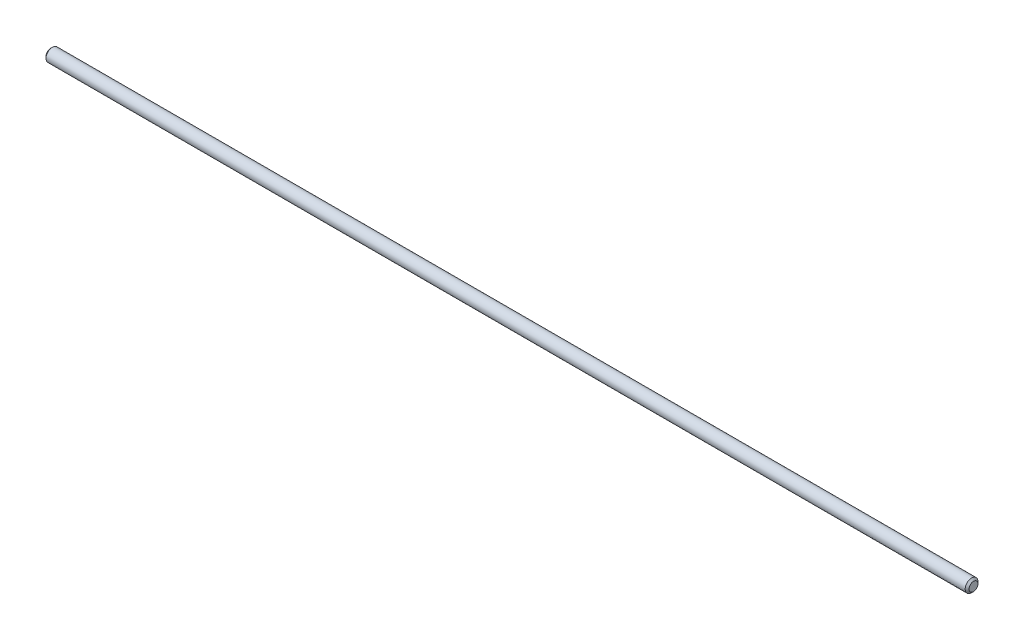
ISO-10303-21;
HEADER;
FILE_DESCRIPTION(('STEP AP214'),'2;1');
FILE_NAME('part.step','',(''),(''),'','','');
FILE_SCHEMA(('AUTOMOTIVE_DESIGN { 1 0 10303 214 1 1 1 1 }'));
ENDSEC;
DATA;
#1=APPLICATION_CONTEXT('core data for automotive mechanical design processes');
#2=APPLICATION_PROTOCOL_DEFINITION('international standard','automotive_design',2000,#1);
#3=PRODUCT_CONTEXT('',#1,'mechanical');
#4=PRODUCT('Part','Part','',(#3));
#5=PRODUCT_RELATED_PRODUCT_CATEGORY('part','',(#4));
#6=PRODUCT_DEFINITION_FORMATION('','',#4);
#7=PRODUCT_DEFINITION_CONTEXT('part definition',#1,'design');
#8=PRODUCT_DEFINITION('design','',#6,#7);
#9=PRODUCT_DEFINITION_SHAPE('','',#8);
#10=(LENGTH_UNIT() NAMED_UNIT(*) SI_UNIT(.MILLI.,.METRE.));
#11=(NAMED_UNIT(*) PLANE_ANGLE_UNIT() SI_UNIT($,.RADIAN.));
#12=(NAMED_UNIT(*) SI_UNIT($,.STERADIAN.) SOLID_ANGLE_UNIT());
#13=UNCERTAINTY_MEASURE_WITH_UNIT(LENGTH_MEASURE(1.E-05),#10,'distance_accuracy_value','');
#14=(GEOMETRIC_REPRESENTATION_CONTEXT(3) GLOBAL_UNCERTAINTY_ASSIGNED_CONTEXT((#13)) GLOBAL_UNIT_ASSIGNED_CONTEXT((#10,
#11,#12)) REPRESENTATION_CONTEXT('',''));
#15=CARTESIAN_POINT('',(0.,0.,0.));
#16=DIRECTION('',(0.,0.,1.));
#17=DIRECTION('',(1.,0.,0.));
#18=AXIS2_PLACEMENT_3D('',#15,#16,#17);
#19=CARTESIAN_POINT('',(-228.6,0.,0.));
#20=DIRECTION('',(1.,0.,0.));
#21=DIRECTION('',(0.,0.,-1.));
#22=AXIS2_PLACEMENT_3D('',#19,#20,#21);
#23=CYLINDRICAL_SURFACE('',#22,3.175);
#24=CARTESIAN_POINT('',(-227.6475,0.,0.));
#25=DIRECTION('',(1.,0.,0.));
#26=DIRECTION('',(0.,0.,-1.));
#27=AXIS2_PLACEMENT_3D('',#24,#25,#26);
#28=CIRCLE('',#27,3.175);
#29=CARTESIAN_POINT('',(-227.6475,0.,-3.175));
#30=VERTEX_POINT('',#29);
#31=EDGE_CURVE('E43',#30,#30,#28,.T.);
#32=ORIENTED_EDGE('',*,*,#31,.T.);
#33=EDGE_LOOP('',(#32));
#34=FACE_BOUND('',#33,.T.);
#35=CARTESIAN_POINT('',(227.6475,0.,0.));
#36=DIRECTION('',(1.,0.,0.));
#37=DIRECTION('',(0.,0.,-1.));
#38=AXIS2_PLACEMENT_3D('',#35,#36,#37);
#39=CIRCLE('',#38,3.175);
#40=CARTESIAN_POINT('',(227.6475,0.,-3.175));
#41=VERTEX_POINT('',#40);
#42=EDGE_CURVE('E47',#41,#41,#39,.F.);
#43=ORIENTED_EDGE('',*,*,#42,.T.);
#44=EDGE_LOOP('',(#43));
#45=FACE_BOUND('',#44,.T.);
#46=ADVANCED_FACE('F32',(#34,#45),#23,.T.);
#47=CARTESIAN_POINT('',(-228.6,0.,0.));
#48=DIRECTION('',(1.,0.,0.));
#49=DIRECTION('',(0.,0.,-1.));
#50=AXIS2_PLACEMENT_3D('',#47,#48,#49);
#51=PLANE('',#50);
#52=CARTESIAN_POINT('',(-228.6,0.,0.));
#53=DIRECTION('',(1.,0.,0.));
#54=DIRECTION('',(0.,0.,-1.));
#55=AXIS2_PLACEMENT_3D('',#52,#53,#54);
#56=CIRCLE('',#55,2.22249999999996);
#57=CARTESIAN_POINT('',(-228.6,0.,-2.22249999999996));
#58=VERTEX_POINT('',#57);
#59=EDGE_CURVE('E39',#58,#58,#56,.F.);
#60=ORIENTED_EDGE('',*,*,#59,.T.);
#61=EDGE_LOOP('',(#60));
#62=FACE_BOUND('',#61,.T.);
#63=ADVANCED_FACE('F63',(#62),#51,.F.);
#64=CARTESIAN_POINT('',(228.6,0.,0.));
#65=DIRECTION('',(1.,0.,0.));
#66=DIRECTION('',(0.,0.,-1.));
#67=AXIS2_PLACEMENT_3D('',#64,#65,#66);
#68=PLANE('',#67);
#69=CARTESIAN_POINT('',(228.6,0.,0.));
#70=DIRECTION('',(1.,0.,0.));
#71=DIRECTION('',(0.,0.,-1.));
#72=AXIS2_PLACEMENT_3D('',#69,#70,#71);
#73=CIRCLE('',#72,2.22249999999996);
#74=CARTESIAN_POINT('',(228.6,0.,-2.22249999999996));
#75=VERTEX_POINT('',#74);
#76=EDGE_CURVE('E10',#75,#75,#73,.T.);
#77=ORIENTED_EDGE('',*,*,#76,.T.);
#78=EDGE_LOOP('',(#77));
#79=FACE_BOUND('',#78,.T.);
#80=ADVANCED_FACE('F60',(#79),#68,.T.);
#81=CARTESIAN_POINT('',(-227.6475,0.,0.));
#82=DIRECTION('',(1.,0.,0.));
#83=DIRECTION('',(0.,0.,-1.));
#84=AXIS2_PLACEMENT_3D('',#81,#82,#83);
#85=CONICAL_SURFACE('',#84,3.175,0.785398163397443);
#86=ORIENTED_EDGE('',*,*,#59,.F.);
#87=EDGE_LOOP('',(#86));
#88=FACE_BOUND('',#87,.T.);
#89=ORIENTED_EDGE('',*,*,#31,.F.);
#90=EDGE_LOOP('',(#89));
#91=FACE_BOUND('',#90,.T.);
#92=ADVANCED_FACE('F56',(#88,#91),#85,.T.);
#93=CARTESIAN_POINT('',(228.6,0.,0.));
#94=DIRECTION('',(-1.,0.,0.));
#95=DIRECTION('',(0.,0.,1.));
#96=AXIS2_PLACEMENT_3D('',#93,#94,#95);
#97=CONICAL_SURFACE('',#96,2.22249999999996,0.785398163397487);
#98=ORIENTED_EDGE('',*,*,#42,.F.);
#99=EDGE_LOOP('',(#98));
#100=FACE_BOUND('',#99,.T.);
#101=ORIENTED_EDGE('',*,*,#76,.F.);
#102=EDGE_LOOP('',(#101));
#103=FACE_BOUND('',#102,.T.);
#104=ADVANCED_FACE('F34',(#100,#103),#97,.T.);
#105=CLOSED_SHELL('',(#46,#63,#80,#92,#104));
#106=MANIFOLD_SOLID_BREP('B2',#105);
#107=ADVANCED_BREP_SHAPE_REPRESENTATION('',(#18,#106),#14);
#108=SHAPE_DEFINITION_REPRESENTATION(#9,#107);
ENDSEC;
END-ISO-10303-21;
